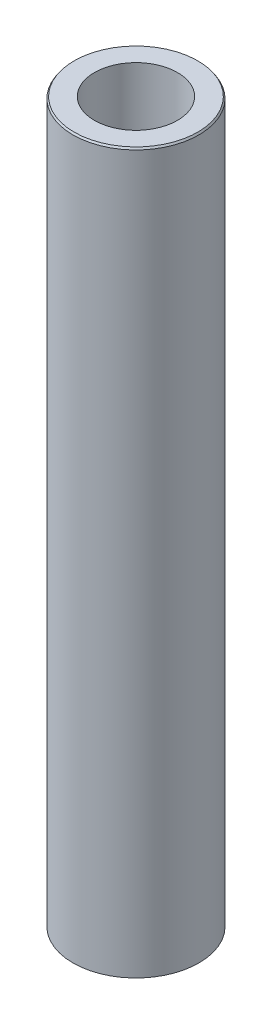
ISO-10303-21;
HEADER;
FILE_DESCRIPTION(('STEP AP214'),'2;1');
FILE_NAME('part.step','',(''),(''),'','','');
FILE_SCHEMA(('AUTOMOTIVE_DESIGN { 1 0 10303 214 1 1 1 1 }'));
ENDSEC;
DATA;
#1=APPLICATION_CONTEXT('core data for automotive mechanical design processes');
#2=APPLICATION_PROTOCOL_DEFINITION('international standard','automotive_design',2000,#1);
#3=PRODUCT_CONTEXT('',#1,'mechanical');
#4=PRODUCT('Part','Part','',(#3));
#5=PRODUCT_RELATED_PRODUCT_CATEGORY('part','',(#4));
#6=PRODUCT_DEFINITION_FORMATION('','',#4);
#7=PRODUCT_DEFINITION_CONTEXT('part definition',#1,'design');
#8=PRODUCT_DEFINITION('design','',#6,#7);
#9=PRODUCT_DEFINITION_SHAPE('','',#8);
#10=(LENGTH_UNIT() NAMED_UNIT(*) SI_UNIT(.MILLI.,.METRE.));
#11=(NAMED_UNIT(*) PLANE_ANGLE_UNIT() SI_UNIT($,.RADIAN.));
#12=(NAMED_UNIT(*) SI_UNIT($,.STERADIAN.) SOLID_ANGLE_UNIT());
#13=UNCERTAINTY_MEASURE_WITH_UNIT(LENGTH_MEASURE(1.E-05),#10,'distance_accuracy_value','');
#14=(GEOMETRIC_REPRESENTATION_CONTEXT(3) GLOBAL_UNCERTAINTY_ASSIGNED_CONTEXT((#13)) GLOBAL_UNIT_ASSIGNED_CONTEXT((#10,
#11,#12)) REPRESENTATION_CONTEXT('',''));
#15=CARTESIAN_POINT('',(0.,0.,0.));
#16=DIRECTION('',(0.,0.,1.));
#17=DIRECTION('',(1.,0.,0.));
#18=AXIS2_PLACEMENT_3D('',#15,#16,#17);
#19=CARTESIAN_POINT('',(0.,600.,0.));
#20=DIRECTION('',(0.,-1.,0.));
#21=DIRECTION('',(0.,0.,-1.));
#22=AXIS2_PLACEMENT_3D('',#19,#20,#21);
#23=CYLINDRICAL_SURFACE('',#22,52.5);
#24=CARTESIAN_POINT('',(0.,598.511565629159,0.));
#25=DIRECTION('',(0.,1.,0.));
#26=DIRECTION('',(0.,0.,1.));
#27=AXIS2_PLACEMENT_3D('',#24,#25,#26);
#28=CIRCLE('',#27,52.5);
#29=CARTESIAN_POINT('',(0.,598.511565629159,52.5));
#30=VERTEX_POINT('',#29);
#31=EDGE_CURVE('E50',#30,#30,#28,.F.);
#32=ORIENTED_EDGE('',*,*,#31,.T.);
#33=EDGE_LOOP('',(#32));
#34=FACE_BOUND('',#33,.T.);
#35=CARTESIAN_POINT('',(0.,1.0000490783354,0.));
#36=DIRECTION('',(0.,1.,0.));
#37=DIRECTION('',(0.,0.,1.));
#38=AXIS2_PLACEMENT_3D('',#35,#36,#37);
#39=CIRCLE('',#38,52.5);
#40=CARTESIAN_POINT('',(0.,1.0000490783354,52.5));
#41=VERTEX_POINT('',#40);
#42=EDGE_CURVE('E51',#41,#41,#39,.T.);
#43=ORIENTED_EDGE('',*,*,#42,.T.);
#44=EDGE_LOOP('',(#43));
#45=FACE_BOUND('',#44,.T.);
#46=ADVANCED_FACE('F39',(#34,#45),#23,.T.);
#47=CARTESIAN_POINT('',(0.,600.,0.));
#48=DIRECTION('',(0.,1.,0.));
#49=DIRECTION('',(0.,0.,1.));
#50=AXIS2_PLACEMENT_3D('',#47,#48,#49);
#51=PLANE('',#50);
#52=CARTESIAN_POINT('',(0.,600.,0.));
#53=DIRECTION('',(0.,1.,0.));
#54=DIRECTION('',(0.,0.,1.));
#55=AXIS2_PLACEMENT_3D('',#52,#53,#54);
#56=CIRCLE('',#55,51.4999509216647);
#57=CARTESIAN_POINT('',(0.,600.,51.4999509216647));
#58=VERTEX_POINT('',#57);
#59=EDGE_CURVE('E54',#58,#58,#56,.T.);
#60=ORIENTED_EDGE('',*,*,#59,.T.);
#61=EDGE_LOOP('',(#60));
#62=FACE_BOUND('',#61,.T.);
#63=CARTESIAN_POINT('',(0.,600.,0.));
#64=DIRECTION('',(0.,1.,0.));
#65=DIRECTION('',(0.,0.,1.));
#66=AXIS2_PLACEMENT_3D('',#63,#64,#65);
#67=CIRCLE('',#66,34.5817733795422);
#68=CARTESIAN_POINT('',(0.,600.,34.5817733795422));
#69=VERTEX_POINT('',#68);
#70=EDGE_CURVE('E58',#69,#69,#67,.T.);
#71=ORIENTED_EDGE('',*,*,#70,.F.);
#72=EDGE_LOOP('',(#71));
#73=FACE_BOUND('',#72,.T.);
#74=ADVANCED_FACE('F69',(#62,#73),#51,.T.);
#75=CARTESIAN_POINT('',(0.,0.,0.));
#76=DIRECTION('',(0.,1.,0.));
#77=DIRECTION('',(0.,0.,1.));
#78=AXIS2_PLACEMENT_3D('',#75,#76,#77);
#79=PLANE('',#78);
#80=CARTESIAN_POINT('',(0.,0.,0.));
#81=DIRECTION('',(0.,1.,0.));
#82=DIRECTION('',(0.,0.,1.));
#83=AXIS2_PLACEMENT_3D('',#80,#81,#82);
#84=CIRCLE('',#83,51.0115656291585);
#85=CARTESIAN_POINT('',(0.,0.,51.0115656291585));
#86=VERTEX_POINT('',#85);
#87=EDGE_CURVE('E10',#86,#86,#84,.F.);
#88=ORIENTED_EDGE('',*,*,#87,.T.);
#89=EDGE_LOOP('',(#88));
#90=FACE_BOUND('',#89,.T.);
#91=CARTESIAN_POINT('',(0.,0.,0.));
#92=DIRECTION('',(0.,1.,0.));
#93=DIRECTION('',(0.,0.,1.));
#94=AXIS2_PLACEMENT_3D('',#91,#92,#93);
#95=CIRCLE('',#94,34.5817733795422);
#96=CARTESIAN_POINT('',(0.,0.,34.5817733795422));
#97=VERTEX_POINT('',#96);
#98=EDGE_CURVE('E63',#97,#97,#95,.T.);
#99=ORIENTED_EDGE('',*,*,#98,.T.);
#100=EDGE_LOOP('',(#99));
#101=FACE_BOUND('',#100,.T.);
#102=ADVANCED_FACE('F75',(#90,#101),#79,.F.);
#103=CARTESIAN_POINT('',(0.,600.,0.));
#104=DIRECTION('',(0.,-1.,0.));
#105=DIRECTION('',(0.,0.,-1.));
#106=AXIS2_PLACEMENT_3D('',#103,#104,#105);
#107=CYLINDRICAL_SURFACE('',#106,34.5817733795422);
#108=ORIENTED_EDGE('',*,*,#70,.T.);
#109=EDGE_LOOP('',(#108));
#110=FACE_BOUND('',#109,.T.);
#111=ORIENTED_EDGE('',*,*,#98,.F.);
#112=EDGE_LOOP('',(#111));
#113=FACE_BOUND('',#112,.T.);
#114=ADVANCED_FACE('F70',(#110,#113),#107,.F.);
#115=CARTESIAN_POINT('',(0.,600.,0.));
#116=DIRECTION('',(0.,-1.,0.));
#117=DIRECTION('',(0.,0.,-1.));
#118=AXIS2_PLACEMENT_3D('',#115,#116,#117);
#119=CONICAL_SURFACE('',#118,51.4999509216647,0.591603059538665);
#120=ORIENTED_EDGE('',*,*,#31,.F.);
#121=EDGE_LOOP('',(#120));
#122=FACE_BOUND('',#121,.T.);
#123=ORIENTED_EDGE('',*,*,#59,.F.);
#124=EDGE_LOOP('',(#123));
#125=FACE_BOUND('',#124,.T.);
#126=ADVANCED_FACE('F81',(#122,#125),#119,.T.);
#127=CARTESIAN_POINT('',(0.,1.0000490783354,0.));
#128=DIRECTION('',(0.,1.,0.));
#129=DIRECTION('',(0.,0.,1.));
#130=AXIS2_PLACEMENT_3D('',#127,#128,#129);
#131=CONICAL_SURFACE('',#130,52.5,0.979193267256217);
#132=ORIENTED_EDGE('',*,*,#87,.F.);
#133=EDGE_LOOP('',(#132));
#134=FACE_BOUND('',#133,.T.);
#135=ORIENTED_EDGE('',*,*,#42,.F.);
#136=EDGE_LOOP('',(#135));
#137=FACE_BOUND('',#136,.T.);
#138=ADVANCED_FACE('F45',(#134,#137),#131,.T.);
#139=CLOSED_SHELL('',(#46,#74,#102,#114,#126,#138));
#140=MANIFOLD_SOLID_BREP('B2',#139);
#141=ADVANCED_BREP_SHAPE_REPRESENTATION('',(#18,#140),#14);
#142=SHAPE_DEFINITION_REPRESENTATION(#9,#141);
ENDSEC;
END-ISO-10303-21;
